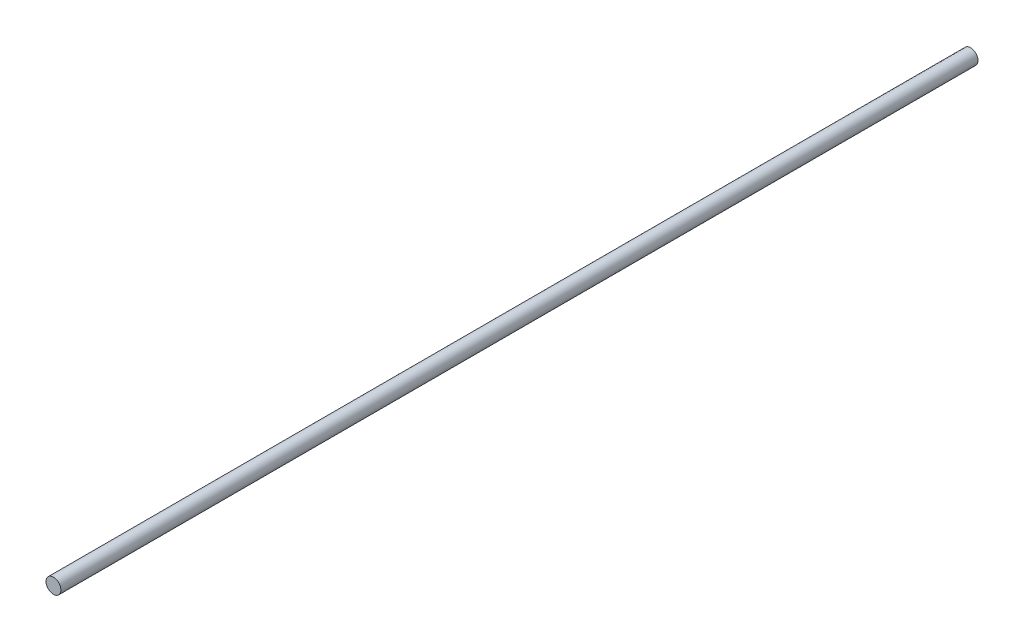
ISO-10303-21;
HEADER;
FILE_DESCRIPTION(('STEP AP214'),'2;1');
FILE_NAME('part.step','',(''),(''),'','','');
FILE_SCHEMA(('AUTOMOTIVE_DESIGN { 1 0 10303 214 1 1 1 1 }'));
ENDSEC;
DATA;
#1=APPLICATION_CONTEXT('core data for automotive mechanical design processes');
#2=APPLICATION_PROTOCOL_DEFINITION('international standard','automotive_design',2000,#1);
#3=PRODUCT_CONTEXT('',#1,'mechanical');
#4=PRODUCT('Part','Part','',(#3));
#5=PRODUCT_RELATED_PRODUCT_CATEGORY('part','',(#4));
#6=PRODUCT_DEFINITION_FORMATION('','',#4);
#7=PRODUCT_DEFINITION_CONTEXT('part definition',#1,'design');
#8=PRODUCT_DEFINITION('design','',#6,#7);
#9=PRODUCT_DEFINITION_SHAPE('','',#8);
#10=(LENGTH_UNIT() NAMED_UNIT(*) SI_UNIT(.MILLI.,.METRE.));
#11=(NAMED_UNIT(*) PLANE_ANGLE_UNIT() SI_UNIT($,.RADIAN.));
#12=(NAMED_UNIT(*) SI_UNIT($,.STERADIAN.) SOLID_ANGLE_UNIT());
#13=UNCERTAINTY_MEASURE_WITH_UNIT(LENGTH_MEASURE(1.E-05),#10,'distance_accuracy_value','');
#14=(GEOMETRIC_REPRESENTATION_CONTEXT(3) GLOBAL_UNCERTAINTY_ASSIGNED_CONTEXT((#13)) GLOBAL_UNIT_ASSIGNED_CONTEXT((#10,
#11,#12)) REPRESENTATION_CONTEXT('',''));
#15=CARTESIAN_POINT('',(0.,0.,0.));
#16=DIRECTION('',(0.,0.,1.));
#17=DIRECTION('',(1.,0.,0.));
#18=AXIS2_PLACEMENT_3D('',#15,#16,#17);
#19=CARTESIAN_POINT('',(0.,0.,502.48));
#20=DIRECTION('',(0.,0.,-1.));
#21=DIRECTION('',(-1.,0.,0.));
#22=AXIS2_PLACEMENT_3D('',#19,#20,#21);
#23=CYLINDRICAL_SURFACE('',#22,4.08024474647678);
#24=CARTESIAN_POINT('',(0.,0.,502.48));
#25=DIRECTION('',(0.,0.,-1.));
#26=DIRECTION('',(-1.,0.,0.));
#27=AXIS2_PLACEMENT_3D('',#24,#25,#26);
#28=CIRCLE('',#27,4.08024474647682);
#29=CARTESIAN_POINT('',(-4.08024474647688,0.,502.48));
#30=VERTEX_POINT('',#29);
#31=EDGE_CURVE('E10',#30,#30,#28,.T.);
#32=ORIENTED_EDGE('',*,*,#31,.T.);
#33=EDGE_LOOP('',(#32));
#34=FACE_BOUND('',#33,.T.);
#35=CARTESIAN_POINT('',(0.,0.,0.));
#36=DIRECTION('',(0.,0.,-1.));
#37=DIRECTION('',(-1.,0.,0.));
#38=AXIS2_PLACEMENT_3D('',#35,#36,#37);
#39=CIRCLE('',#38,4.08024474647675);
#40=CARTESIAN_POINT('',(-4.08024474647675,0.,0.));
#41=VERTEX_POINT('',#40);
#42=EDGE_CURVE('E39',#41,#41,#39,.T.);
#43=ORIENTED_EDGE('',*,*,#42,.F.);
#44=EDGE_LOOP('',(#43));
#45=FACE_BOUND('',#44,.T.);
#46=ADVANCED_FACE('F33',(#34,#45),#23,.T.);
#47=CARTESIAN_POINT('',(4.08024474647675,0.,502.48));
#48=DIRECTION('',(0.,0.,1.));
#49=DIRECTION('',(1.,0.,0.));
#50=AXIS2_PLACEMENT_3D('',#47,#48,#49);
#51=PLANE('',#50);
#52=ORIENTED_EDGE('',*,*,#31,.F.);
#53=EDGE_LOOP('',(#52));
#54=FACE_BOUND('',#53,.T.);
#55=ADVANCED_FACE('F48',(#54),#51,.T.);
#56=CARTESIAN_POINT('',(0.,0.,0.));
#57=DIRECTION('',(0.,0.,-1.));
#58=DIRECTION('',(-1.,0.,0.));
#59=AXIS2_PLACEMENT_3D('',#56,#57,#58);
#60=PLANE('',#59);
#61=ORIENTED_EDGE('',*,*,#42,.T.);
#62=EDGE_LOOP('',(#61));
#63=FACE_BOUND('',#62,.T.);
#64=ADVANCED_FACE('F45',(#63),#60,.T.);
#65=CLOSED_SHELL('',(#46,#55,#64));
#66=MANIFOLD_SOLID_BREP('B2',#65);
#67=ADVANCED_BREP_SHAPE_REPRESENTATION('',(#18,#66),#14);
#68=SHAPE_DEFINITION_REPRESENTATION(#9,#67);
ENDSEC;
END-ISO-10303-21;
